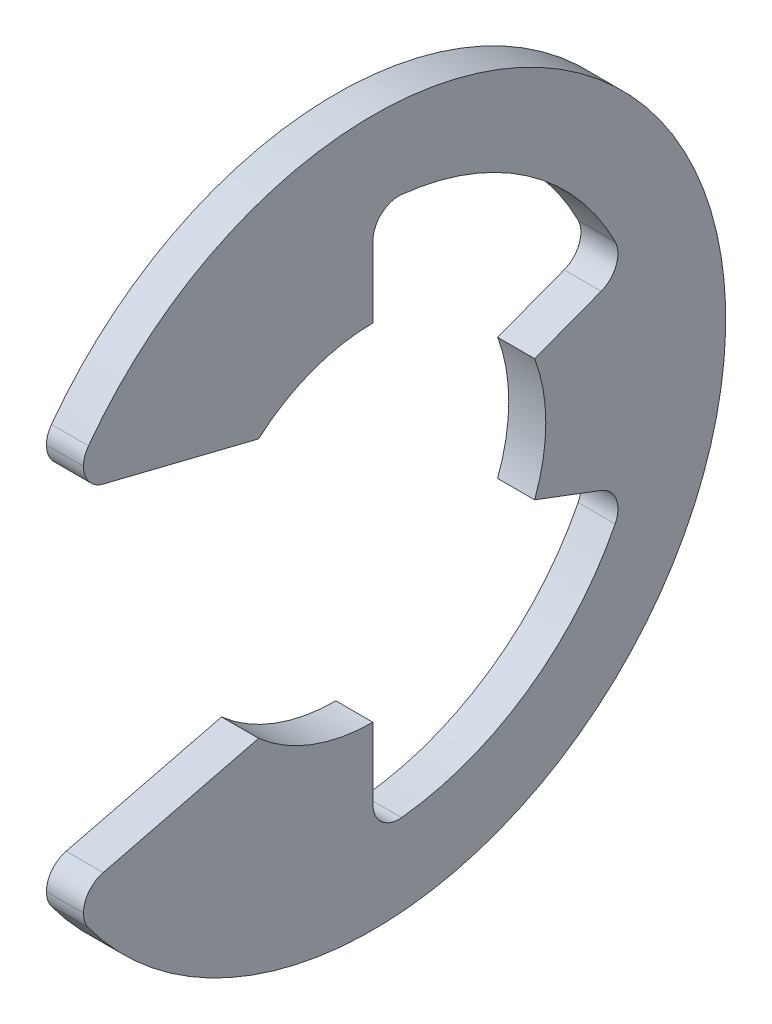
ISO-10303-21;
HEADER;
FILE_DESCRIPTION(('STEP AP214'),'2;1');
FILE_NAME('part.step','',(''),(''),'','','');
FILE_SCHEMA(('AUTOMOTIVE_DESIGN { 1 0 10303 214 1 1 1 1 }'));
ENDSEC;
DATA;
#1=APPLICATION_CONTEXT('core data for automotive mechanical design processes');
#2=APPLICATION_PROTOCOL_DEFINITION('international standard','automotive_design',2000,#1);
#3=PRODUCT_CONTEXT('',#1,'mechanical');
#4=PRODUCT('Part','Part','',(#3));
#5=PRODUCT_RELATED_PRODUCT_CATEGORY('part','',(#4));
#6=PRODUCT_DEFINITION_FORMATION('','',#4);
#7=PRODUCT_DEFINITION_CONTEXT('part definition',#1,'design');
#8=PRODUCT_DEFINITION('design','',#6,#7);
#9=PRODUCT_DEFINITION_SHAPE('','',#8);
#10=(LENGTH_UNIT() NAMED_UNIT(*) SI_UNIT(.MILLI.,.METRE.));
#11=(NAMED_UNIT(*) PLANE_ANGLE_UNIT() SI_UNIT($,.RADIAN.));
#12=(NAMED_UNIT(*) SI_UNIT($,.STERADIAN.) SOLID_ANGLE_UNIT());
#13=UNCERTAINTY_MEASURE_WITH_UNIT(LENGTH_MEASURE(1.E-05),#10,'distance_accuracy_value','');
#14=(GEOMETRIC_REPRESENTATION_CONTEXT(3) GLOBAL_UNCERTAINTY_ASSIGNED_CONTEXT((#13)) GLOBAL_UNIT_ASSIGNED_CONTEXT((#10,
#11,#12)) REPRESENTATION_CONTEXT('',''));
#15=CARTESIAN_POINT('',(0.,0.,0.));
#16=DIRECTION('',(0.,0.,1.));
#17=DIRECTION('',(1.,0.,0.));
#18=AXIS2_PLACEMENT_3D('',#15,#16,#17);
#19=CARTESIAN_POINT('',(0.5334,3.18296391887085,-6.30917472174839));
#20=DIRECTION('',(-1.,0.,0.));
#21=DIRECTION('',(0.,0.,1.));
#22=AXIS2_PLACEMENT_3D('',#19,#20,#21);
#23=CYLINDRICAL_SURFACE('',#22,0.74676);
#24=CARTESIAN_POINT('',(0.5334,3.18296391887085,-6.30917472174839));
#25=DIRECTION('',(-1.,0.,0.));
#26=DIRECTION('',(0.,0.,-1.));
#27=AXIS2_PLACEMENT_3D('',#24,#25,#26);
#28=CIRCLE('',#27,0.74676);
#29=CARTESIAN_POINT('',(0.5334,3.51932193149276,-6.97589339176224));
#30=VERTEX_POINT('',#29);
#31=CARTESIAN_POINT('',(0.5334,2.48443390133403,-6.57319425170782));
#32=VERTEX_POINT('',#31);
#33=EDGE_CURVE('E410',#30,#32,#28,.T.);
#34=ORIENTED_EDGE('',*,*,#33,.F.);
#35=DIRECTION('',(1.,0.,0.));
#36=VECTOR('',#35,1.);
#37=CARTESIAN_POINT('',(0.5334,3.51932193149276,-6.97589339176224));
#38=LINE('',#37,#36);
#39=CARTESIAN_POINT('',(-0.5334,3.51932193149276,-6.97589339176224));
#40=VERTEX_POINT('',#39);
#41=EDGE_CURVE('E289',#40,#30,#38,.T.);
#42=ORIENTED_EDGE('',*,*,#41,.F.);
#43=CARTESIAN_POINT('',(-0.5334,3.18296391887085,-6.30917472174839));
#44=DIRECTION('',(1.,0.,0.));
#45=DIRECTION('',(0.,0.,-1.));
#46=AXIS2_PLACEMENT_3D('',#43,#44,#45);
#47=CIRCLE('',#46,0.74676);
#48=CARTESIAN_POINT('',(-0.5334,2.48443390133403,-6.57319425170782));
#49=VERTEX_POINT('',#48);
#50=EDGE_CURVE('E424',#49,#40,#47,.T.);
#51=ORIENTED_EDGE('',*,*,#50,.F.);
#52=DIRECTION('',(-1.,0.,0.));
#53=VECTOR('',#52,1.);
#54=CARTESIAN_POINT('',(-0.5334,2.48443390133403,-6.57319425170782));
#55=LINE('',#54,#53);
#56=EDGE_CURVE('E238',#32,#49,#55,.T.);
#57=ORIENTED_EDGE('',*,*,#56,.F.);
#58=EDGE_LOOP('',(#34,#42,#51,#57));
#59=FACE_BOUND('',#58,.T.);
#60=ADVANCED_FACE('F16',(#59),#23,.F.);
#61=CARTESIAN_POINT('',(0.5334,-3.18296391887085,-6.30917472174839));
#62=DIRECTION('',(-1.,0.,0.));
#63=DIRECTION('',(0.,0.,1.));
#64=AXIS2_PLACEMENT_3D('',#61,#62,#63);
#65=CYLINDRICAL_SURFACE('',#64,0.74676);
#66=CARTESIAN_POINT('',(0.5334,-3.18296391887085,-6.30917472174839));
#67=DIRECTION('',(-1.,0.,0.));
#68=DIRECTION('',(0.,0.,-1.));
#69=AXIS2_PLACEMENT_3D('',#66,#67,#68);
#70=CIRCLE('',#69,0.74676);
#71=CARTESIAN_POINT('',(0.5334,-2.48443390133402,-6.57319425170782));
#72=VERTEX_POINT('',#71);
#73=CARTESIAN_POINT('',(0.5334,-3.51932193149276,-6.97589339176224));
#74=VERTEX_POINT('',#73);
#75=EDGE_CURVE('E409',#72,#74,#70,.T.);
#76=ORIENTED_EDGE('',*,*,#75,.F.);
#77=DIRECTION('',(1.,0.,0.));
#78=VECTOR('',#77,1.);
#79=CARTESIAN_POINT('',(0.5334,-2.48443390133402,-6.57319425170782));
#80=LINE('',#79,#78);
#81=CARTESIAN_POINT('',(-0.5334,-2.48443390133402,-6.57319425170782));
#82=VERTEX_POINT('',#81);
#83=EDGE_CURVE('E349',#82,#72,#80,.T.);
#84=ORIENTED_EDGE('',*,*,#83,.F.);
#85=CARTESIAN_POINT('',(-0.5334,-3.18296391887085,-6.30917472174839));
#86=DIRECTION('',(1.,0.,0.));
#87=DIRECTION('',(0.,0.,-1.));
#88=AXIS2_PLACEMENT_3D('',#85,#86,#87);
#89=CIRCLE('',#88,0.74676);
#90=CARTESIAN_POINT('',(-0.5334,-3.51932193149276,-6.97589339176224));
#91=VERTEX_POINT('',#90);
#92=EDGE_CURVE('E423',#91,#82,#89,.T.);
#93=ORIENTED_EDGE('',*,*,#92,.F.);
#94=DIRECTION('',(-1.,0.,0.));
#95=VECTOR('',#94,1.);
#96=CARTESIAN_POINT('',(0.5334,-3.51932193149276,-6.97589339176224));
#97=LINE('',#96,#95);
#98=EDGE_CURVE('E367',#74,#91,#97,.T.);
#99=ORIENTED_EDGE('',*,*,#98,.F.);
#100=EDGE_LOOP('',(#76,#84,#93,#99));
#101=FACE_BOUND('',#100,.T.);
#102=ADVANCED_FACE('F18',(#101),#65,.F.);
#103=CARTESIAN_POINT('',(0.5334,5.56971982551659,7.58863020332704));
#104=DIRECTION('',(-1.,0.,0.));
#105=DIRECTION('',(0.,0.,1.));
#106=AXIS2_PLACEMENT_3D('',#103,#104,#105);
#107=CYLINDRICAL_SURFACE('',#106,0.74676);
#108=DIRECTION('',(-1.,0.,0.));
#109=VECTOR('',#108,1.);
#110=CARTESIAN_POINT('',(0.5334,5.56971982551659,8.33539020332704));
#111=LINE('',#110,#109);
#112=CARTESIAN_POINT('',(0.5334,5.56971982551659,8.33539020332704));
#113=VERTEX_POINT('',#112);
#114=CARTESIAN_POINT('',(-0.5334,5.56971982551659,8.33539020332704));
#115=VERTEX_POINT('',#114);
#116=EDGE_CURVE('E220',#113,#115,#111,.T.);
#117=ORIENTED_EDGE('',*,*,#116,.F.);
#118=CARTESIAN_POINT('',(0.5334,5.56971982551659,7.58863020332704));
#119=DIRECTION('',(1.,0.,0.));
#120=DIRECTION('',(0.,0.,-1.));
#121=AXIS2_PLACEMENT_3D('',#118,#119,#120);
#122=CIRCLE('',#121,0.74676);
#123=CARTESIAN_POINT('',(0.5334,6.01157023801035,8.19064242129201));
#124=VERTEX_POINT('',#123);
#125=EDGE_CURVE('E205',#124,#113,#122,.T.);
#126=ORIENTED_EDGE('',*,*,#125,.F.);
#127=DIRECTION('',(1.,0.,0.));
#128=VECTOR('',#127,1.);
#129=CARTESIAN_POINT('',(0.5334,6.01157023801035,8.19064242129201));
#130=LINE('',#129,#128);
#131=CARTESIAN_POINT('',(-0.5334,6.01157023801035,8.19064242129201));
#132=VERTEX_POINT('',#131);
#133=EDGE_CURVE('E278',#132,#124,#130,.T.);
#134=ORIENTED_EDGE('',*,*,#133,.F.);
#135=CARTESIAN_POINT('',(-0.5334,5.56971982551659,7.58863020332704));
#136=DIRECTION('',(-1.,0.,0.));
#137=DIRECTION('',(0.,0.,-1.));
#138=AXIS2_PLACEMENT_3D('',#135,#136,#137);
#139=CIRCLE('',#138,0.74676);
#140=EDGE_CURVE('E11',#115,#132,#139,.T.);
#141=ORIENTED_EDGE('',*,*,#140,.F.);
#142=EDGE_LOOP('',(#117,#126,#134,#141));
#143=FACE_BOUND('',#142,.T.);
#144=ADVANCED_FACE('F217',(#143),#107,.T.);
#145=CARTESIAN_POINT('',(0.5334,-5.56971982551659,7.58863020332704));
#146=DIRECTION('',(-1.,0.,0.));
#147=DIRECTION('',(0.,0.,1.));
#148=AXIS2_PLACEMENT_3D('',#145,#146,#147);
#149=CYLINDRICAL_SURFACE('',#148,0.74676);
#150=DIRECTION('',(-1.,0.,0.));
#151=VECTOR('',#150,1.);
#152=CARTESIAN_POINT('',(0.5334,-5.56971982551659,8.33539020332704));
#153=LINE('',#152,#151);
#154=CARTESIAN_POINT('',(0.5334,-5.56971982551659,8.33539020332704));
#155=VERTEX_POINT('',#154);
#156=CARTESIAN_POINT('',(-0.5334,-5.56971982551659,8.33539020332704));
#157=VERTEX_POINT('',#156);
#158=EDGE_CURVE('E267',#155,#157,#153,.T.);
#159=ORIENTED_EDGE('',*,*,#158,.F.);
#160=CARTESIAN_POINT('',(0.5334,-5.56971982551659,7.58863020332704));
#161=DIRECTION('',(1.,0.,0.));
#162=DIRECTION('',(0.,0.,-1.));
#163=AXIS2_PLACEMENT_3D('',#160,#161,#162);
#164=CIRCLE('',#163,0.74676);
#165=CARTESIAN_POINT('',(0.5334,-4.84496174240152,7.76856413164343));
#166=VERTEX_POINT('',#165);
#167=EDGE_CURVE('E36',#166,#155,#164,.T.);
#168=ORIENTED_EDGE('',*,*,#167,.F.);
#169=DIRECTION('',(1.,0.,0.));
#170=VECTOR('',#169,1.);
#171=CARTESIAN_POINT('',(0.5334,-4.84496174240152,7.76856413164343));
#172=LINE('',#171,#170);
#173=CARTESIAN_POINT('',(-0.5334,-4.84496174240152,7.76856413164343));
#174=VERTEX_POINT('',#173);
#175=EDGE_CURVE('E386',#174,#166,#172,.T.);
#176=ORIENTED_EDGE('',*,*,#175,.F.);
#177=CARTESIAN_POINT('',(-0.5334,-5.56971982551659,7.58863020332704));
#178=DIRECTION('',(-1.,0.,0.));
#179=DIRECTION('',(0.,0.,-1.));
#180=AXIS2_PLACEMENT_3D('',#177,#178,#179);
#181=CIRCLE('',#180,0.74676);
#182=EDGE_CURVE('E47',#157,#174,#181,.T.);
#183=ORIENTED_EDGE('',*,*,#182,.F.);
#184=EDGE_LOOP('',(#159,#168,#176,#183));
#185=FACE_BOUND('',#184,.T.);
#186=ADVANCED_FACE('F494',(#185),#149,.T.);
#187=CARTESIAN_POINT('',(0.5334,7.02704023617216,-0.74676));
#188=DIRECTION('',(-1.,0.,0.));
#189=DIRECTION('',(0.,0.,1.));
#190=AXIS2_PLACEMENT_3D('',#187,#188,#189);
#191=CYLINDRICAL_SURFACE('',#190,0.74676);
#192=CARTESIAN_POINT('',(0.5334,7.02704023617216,-0.74676));
#193=DIRECTION('',(-1.,0.,0.));
#194=DIRECTION('',(0.,0.,-1.));
#195=AXIS2_PLACEMENT_3D('',#192,#193,#194);
#196=CIRCLE('',#195,0.74676);
#197=CARTESIAN_POINT('',(0.5334,7.02704023617216,0.));
#198=VERTEX_POINT('',#197);
#199=CARTESIAN_POINT('',(0.5334,7.76961896112721,-0.825673464276603));
#200=VERTEX_POINT('',#199);
#201=EDGE_CURVE('E212',#198,#200,#196,.T.);
#202=ORIENTED_EDGE('',*,*,#201,.F.);
#203=DIRECTION('',(1.,0.,0.));
#204=VECTOR('',#203,1.);
#205=CARTESIAN_POINT('',(0.5334,7.02704023617216,0.));
#206=LINE('',#205,#204);
#207=CARTESIAN_POINT('',(-0.5334,7.02704023617216,0.));
#208=VERTEX_POINT('',#207);
#209=EDGE_CURVE('E318',#208,#198,#206,.T.);
#210=ORIENTED_EDGE('',*,*,#209,.F.);
#211=CARTESIAN_POINT('',(-0.5334,7.02704023617216,-0.74676));
#212=DIRECTION('',(1.,0.,0.));
#213=DIRECTION('',(0.,0.,-1.));
#214=AXIS2_PLACEMENT_3D('',#211,#212,#213);
#215=CIRCLE('',#214,0.74676);
#216=CARTESIAN_POINT('',(-0.5334,7.76961896112721,-0.825673464276603));
#217=VERTEX_POINT('',#216);
#218=EDGE_CURVE('E25',#217,#208,#215,.T.);
#219=ORIENTED_EDGE('',*,*,#218,.F.);
#220=DIRECTION('',(-1.,0.,0.));
#221=VECTOR('',#220,1.);
#222=CARTESIAN_POINT('',(0.5334,7.76961896112721,-0.825673464276603));
#223=LINE('',#222,#221);
#224=EDGE_CURVE('E248',#200,#217,#223,.T.);
#225=ORIENTED_EDGE('',*,*,#224,.F.);
#226=EDGE_LOOP('',(#202,#210,#219,#225));
#227=FACE_BOUND('',#226,.T.);
#228=ADVANCED_FACE('F442',(#227),#191,.F.);
#229=CARTESIAN_POINT('',(0.5334,-7.02704023617216,-0.74676));
#230=DIRECTION('',(-1.,0.,0.));
#231=DIRECTION('',(0.,0.,1.));
#232=AXIS2_PLACEMENT_3D('',#229,#230,#231);
#233=CYLINDRICAL_SURFACE('',#232,0.74676);
#234=CARTESIAN_POINT('',(0.5334,-7.02704023617216,-0.74676));
#235=DIRECTION('',(-1.,0.,0.));
#236=DIRECTION('',(0.,0.,-1.));
#237=AXIS2_PLACEMENT_3D('',#234,#235,#236);
#238=CIRCLE('',#237,0.74676);
#239=CARTESIAN_POINT('',(0.5334,-7.76961896112721,-0.825673464276605));
#240=VERTEX_POINT('',#239);
#241=CARTESIAN_POINT('',(0.5334,-7.02704023617216,0.));
#242=VERTEX_POINT('',#241);
#243=EDGE_CURVE('E414',#240,#242,#238,.T.);
#244=ORIENTED_EDGE('',*,*,#243,.F.);
#245=DIRECTION('',(1.,0.,0.));
#246=VECTOR('',#245,1.);
#247=CARTESIAN_POINT('',(0.5334,-7.76961896112721,-0.825673464276605));
#248=LINE('',#247,#246);
#249=CARTESIAN_POINT('',(-0.5334,-7.76961896112721,-0.825673464276605));
#250=VERTEX_POINT('',#249);
#251=EDGE_CURVE('E362',#250,#240,#248,.T.);
#252=ORIENTED_EDGE('',*,*,#251,.F.);
#253=CARTESIAN_POINT('',(-0.5334,-7.02704023617216,-0.74676));
#254=DIRECTION('',(1.,0.,0.));
#255=DIRECTION('',(0.,0.,-1.));
#256=AXIS2_PLACEMENT_3D('',#253,#254,#255);
#257=CIRCLE('',#256,0.74676);
#258=CARTESIAN_POINT('',(-0.5334,-7.02704023617216,0.));
#259=VERTEX_POINT('',#258);
#260=EDGE_CURVE('E416',#259,#250,#257,.T.);
#261=ORIENTED_EDGE('',*,*,#260,.F.);
#262=DIRECTION('',(-1.,0.,0.));
#263=VECTOR('',#262,1.);
#264=CARTESIAN_POINT('',(-0.5334,-7.02704023617216,0.));
#265=LINE('',#264,#263);
#266=EDGE_CURVE('E293',#242,#259,#265,.T.);
#267=ORIENTED_EDGE('',*,*,#266,.F.);
#268=EDGE_LOOP('',(#244,#252,#261,#267));
#269=FACE_BOUND('',#268,.T.);
#270=ADVANCED_FACE('F484',(#269),#233,.F.);
#271=CARTESIAN_POINT('',(-0.5334,0.,0.));
#272=DIRECTION('',(1.,0.,0.));
#273=DIRECTION('',(0.,1.,0.));
#274=AXIS2_PLACEMENT_3D('',#271,#272,#273);
#275=PLANE('',#274);
#276=CARTESIAN_POINT('',(-0.5334,0.,0.));
#277=DIRECTION('',(1.,0.,0.));
#278=DIRECTION('',(0.,0.,-1.));
#279=AXIS2_PLACEMENT_3D('',#276,#277,#278);
#280=CIRCLE('',#279,10.16);
#281=CARTESIAN_POINT('',(-0.5334,-6.01157023801035,8.19064242129201));
#282=VERTEX_POINT('',#281);
#283=EDGE_CURVE('E260',#282,#132,#280,.T.);
#284=ORIENTED_EDGE('',*,*,#283,.F.);
#285=CARTESIAN_POINT('',(-0.5334,-5.56971982551659,7.58863020332704));
#286=DIRECTION('',(-1.,0.,0.));
#287=DIRECTION('',(0.,0.,-1.));
#288=AXIS2_PLACEMENT_3D('',#285,#286,#287);
#289=CIRCLE('',#288,0.74676);
#290=EDGE_CURVE('E272',#282,#157,#289,.T.);
#291=ORIENTED_EDGE('',*,*,#290,.T.);
#292=ORIENTED_EDGE('',*,*,#182,.T.);
#293=DIRECTION('',(0.,-0.240952820606873,0.970536829925373));
#294=VECTOR('',#293,1.);
#295=CARTESIAN_POINT('',(-0.5334,-5.09813480407811,8.78832302088672));
#296=LINE('',#295,#294);
#297=CARTESIAN_POINT('',(-0.5334,-3.7338,3.29290208175099));
#298=VERTEX_POINT('',#297);
#299=EDGE_CURVE('E393',#298,#174,#296,.T.);
#300=ORIENTED_EDGE('',*,*,#299,.F.);
#301=CARTESIAN_POINT('',(-0.5334,0.,0.));
#302=DIRECTION('',(-1.,0.,0.));
#303=DIRECTION('',(0.,0.,-1.));
#304=AXIS2_PLACEMENT_3D('',#301,#302,#303);
#305=CIRCLE('',#304,4.9784);
#306=CARTESIAN_POINT('',(-0.5334,-4.9784,0.));
#307=VERTEX_POINT('',#306);
#308=EDGE_CURVE('E379',#307,#298,#305,.T.);
#309=ORIENTED_EDGE('',*,*,#308,.F.);
#310=DIRECTION('',(0.,1.,0.));
#311=VECTOR('',#310,1.);
#312=CARTESIAN_POINT('',(-0.5334,-4.9784,0.));
#313=LINE('',#312,#311);
#314=EDGE_CURVE('E300',#259,#307,#313,.T.);
#315=ORIENTED_EDGE('',*,*,#314,.F.);
#316=ORIENTED_EDGE('',*,*,#260,.T.);
#317=CARTESIAN_POINT('',(-0.5334,0.,0.));
#318=DIRECTION('',(-1.,0.,0.));
#319=DIRECTION('',(0.,0.,-1.));
#320=AXIS2_PLACEMENT_3D('',#317,#318,#319);
#321=CIRCLE('',#320,7.81336774193548);
#322=EDGE_CURVE('E359',#91,#250,#321,.T.);
#323=ORIENTED_EDGE('',*,*,#322,.F.);
#324=ORIENTED_EDGE('',*,*,#92,.T.);
#325=DIRECTION('',(0.,-0.353553390593274,-0.935414346693485));
#326=VECTOR('',#325,1.);
#327=CARTESIAN_POINT('',(-0.5334,-1.76013019972956,-4.65686678357885));
#328=LINE('',#327,#326);
#329=CARTESIAN_POINT('',(-0.5334,-1.76013019972956,-4.65686678357885));
#330=VERTEX_POINT('',#329);
#331=EDGE_CURVE('E345',#330,#82,#328,.T.);
#332=ORIENTED_EDGE('',*,*,#331,.F.);
#333=CARTESIAN_POINT('',(-0.5334,0.,0.));
#334=DIRECTION('',(-1.,0.,0.));
#335=DIRECTION('',(0.,0.,1.));
#336=AXIS2_PLACEMENT_3D('',#333,#334,#335);
#337=CIRCLE('',#336,4.9784);
#338=CARTESIAN_POINT('',(-0.5334,1.76013019972956,-4.65686678357885));
#339=VERTEX_POINT('',#338);
#340=EDGE_CURVE('E266',#339,#330,#337,.T.);
#341=ORIENTED_EDGE('',*,*,#340,.F.);
#342=DIRECTION('',(0.,-0.353553390593274,0.935414346693485));
#343=VECTOR('',#342,1.);
#344=CARTESIAN_POINT('',(-0.5334,1.76013019972956,-4.65686678357885));
#345=LINE('',#344,#343);
#346=EDGE_CURVE('E245',#49,#339,#345,.T.);
#347=ORIENTED_EDGE('',*,*,#346,.F.);
#348=ORIENTED_EDGE('',*,*,#50,.T.);
#349=CARTESIAN_POINT('',(-0.5334,0.,0.));
#350=DIRECTION('',(-1.,0.,0.));
#351=DIRECTION('',(0.,0.,-1.));
#352=AXIS2_PLACEMENT_3D('',#349,#350,#351);
#353=CIRCLE('',#352,7.81336774193549);
#354=EDGE_CURVE('E255',#217,#40,#353,.T.);
#355=ORIENTED_EDGE('',*,*,#354,.F.);
#356=ORIENTED_EDGE('',*,*,#218,.T.);
#357=DIRECTION('',(0.,1.,0.));
#358=VECTOR('',#357,1.);
#359=CARTESIAN_POINT('',(-0.5334,4.9784,0.));
#360=LINE('',#359,#358);
#361=CARTESIAN_POINT('',(-0.5334,4.9784,0.));
#362=VERTEX_POINT('',#361);
#363=EDGE_CURVE('E314',#362,#208,#360,.T.);
#364=ORIENTED_EDGE('',*,*,#363,.F.);
#365=CARTESIAN_POINT('',(-0.5334,0.,0.));
#366=DIRECTION('',(-1.,0.,0.));
#367=DIRECTION('',(0.,0.,1.));
#368=AXIS2_PLACEMENT_3D('',#365,#366,#367);
#369=CIRCLE('',#368,4.9784);
#370=CARTESIAN_POINT('',(-0.5334,3.7338,3.29290208175099));
#371=VERTEX_POINT('',#370);
#372=EDGE_CURVE('E249',#371,#362,#369,.T.);
#373=ORIENTED_EDGE('',*,*,#372,.F.);
#374=DIRECTION('',(0.,-0.240952820606873,-0.970536829925373));
#375=VECTOR('',#374,1.);
#376=CARTESIAN_POINT('',(-0.5334,5.09813480407811,8.78832302088672));
#377=LINE('',#376,#375);
#378=CARTESIAN_POINT('',(-0.5334,4.84496174240152,7.76856413164343));
#379=VERTEX_POINT('',#378);
#380=EDGE_CURVE('E246',#379,#371,#377,.T.);
#381=ORIENTED_EDGE('',*,*,#380,.F.);
#382=CARTESIAN_POINT('',(-0.5334,5.56971982551659,7.58863020332704));
#383=DIRECTION('',(-1.,0.,0.));
#384=DIRECTION('',(0.,0.,-1.));
#385=AXIS2_PLACEMENT_3D('',#382,#383,#384);
#386=CIRCLE('',#385,0.74676);
#387=EDGE_CURVE('E224',#379,#115,#386,.T.);
#388=ORIENTED_EDGE('',*,*,#387,.T.);
#389=ORIENTED_EDGE('',*,*,#140,.T.);
#390=EDGE_LOOP('',(#284,#291,#292,#300,#309,#315,#316,#323,#324,#332,#341,#347,#348,#355,#356,
#364,#373,#381,#388,#389));
#391=FACE_BOUND('',#390,.T.);
#392=ADVANCED_FACE('F435',(#391),#275,.F.);
#393=CARTESIAN_POINT('',(0.5334,0.,0.));
#394=DIRECTION('',(1.,0.,0.));
#395=DIRECTION('',(0.,1.,0.));
#396=AXIS2_PLACEMENT_3D('',#393,#394,#395);
#397=PLANE('',#396);
#398=DIRECTION('',(0.,-0.240952820606873,0.970536829925373));
#399=VECTOR('',#398,1.);
#400=CARTESIAN_POINT('',(0.5334,-5.09813480407811,8.78832302088672));
#401=LINE('',#400,#399);
#402=CARTESIAN_POINT('',(0.5334,-3.7338,3.29290208175099));
#403=VERTEX_POINT('',#402);
#404=EDGE_CURVE('E394',#403,#166,#401,.T.);
#405=ORIENTED_EDGE('',*,*,#404,.T.);
#406=ORIENTED_EDGE('',*,*,#167,.T.);
#407=CARTESIAN_POINT('',(0.5334,-5.56971982551659,7.58863020332704));
#408=DIRECTION('',(1.,0.,0.));
#409=DIRECTION('',(0.,0.,-1.));
#410=AXIS2_PLACEMENT_3D('',#407,#408,#409);
#411=CIRCLE('',#410,0.74676);
#412=CARTESIAN_POINT('',(0.5334,-6.01157023801035,8.19064242129201));
#413=VERTEX_POINT('',#412);
#414=EDGE_CURVE('E240',#155,#413,#411,.T.);
#415=ORIENTED_EDGE('',*,*,#414,.T.);
#416=CARTESIAN_POINT('',(0.5334,0.,0.));
#417=DIRECTION('',(1.,0.,0.));
#418=DIRECTION('',(0.,0.,-1.));
#419=AXIS2_PLACEMENT_3D('',#416,#417,#418);
#420=CIRCLE('',#419,10.16);
#421=EDGE_CURVE('E207',#413,#124,#420,.T.);
#422=ORIENTED_EDGE('',*,*,#421,.T.);
#423=ORIENTED_EDGE('',*,*,#125,.T.);
#424=CARTESIAN_POINT('',(0.5334,5.56971982551659,7.58863020332704));
#425=DIRECTION('',(1.,0.,0.));
#426=DIRECTION('',(0.,0.,-1.));
#427=AXIS2_PLACEMENT_3D('',#424,#425,#426);
#428=CIRCLE('',#427,0.74676);
#429=CARTESIAN_POINT('',(0.5334,4.84496174240152,7.76856413164343));
#430=VERTEX_POINT('',#429);
#431=EDGE_CURVE('E210',#113,#430,#428,.T.);
#432=ORIENTED_EDGE('',*,*,#431,.T.);
#433=DIRECTION('',(0.,-0.240952820606873,-0.970536829925373));
#434=VECTOR('',#433,1.);
#435=CARTESIAN_POINT('',(0.5334,5.09813480407811,8.78832302088672));
#436=LINE('',#435,#434);
#437=CARTESIAN_POINT('',(0.5334,3.7338,3.29290208175099));
#438=VERTEX_POINT('',#437);
#439=EDGE_CURVE('E283',#430,#438,#436,.T.);
#440=ORIENTED_EDGE('',*,*,#439,.T.);
#441=CARTESIAN_POINT('',(0.5334,0.,0.));
#442=DIRECTION('',(-1.,0.,0.));
#443=DIRECTION('',(0.,0.,1.));
#444=AXIS2_PLACEMENT_3D('',#441,#442,#443);
#445=CIRCLE('',#444,4.9784);
#446=CARTESIAN_POINT('',(0.5334,4.9784,0.));
#447=VERTEX_POINT('',#446);
#448=EDGE_CURVE('E309',#438,#447,#445,.T.);
#449=ORIENTED_EDGE('',*,*,#448,.T.);
#450=DIRECTION('',(0.,1.,0.));
#451=VECTOR('',#450,1.);
#452=CARTESIAN_POINT('',(0.5334,4.9784,0.));
#453=LINE('',#452,#451);
#454=EDGE_CURVE('E325',#447,#198,#453,.T.);
#455=ORIENTED_EDGE('',*,*,#454,.T.);
#456=ORIENTED_EDGE('',*,*,#201,.T.);
#457=CARTESIAN_POINT('',(0.5334,0.,0.));
#458=DIRECTION('',(-1.,0.,0.));
#459=DIRECTION('',(0.,0.,-1.));
#460=AXIS2_PLACEMENT_3D('',#457,#458,#459);
#461=CIRCLE('',#460,7.81336774193549);
#462=EDGE_CURVE('E254',#200,#30,#461,.T.);
#463=ORIENTED_EDGE('',*,*,#462,.T.);
#464=ORIENTED_EDGE('',*,*,#33,.T.);
#465=DIRECTION('',(0.,-0.353553390593274,0.935414346693485));
#466=VECTOR('',#465,1.);
#467=CARTESIAN_POINT('',(0.5334,1.76013019972956,-4.65686678357885));
#468=LINE('',#467,#466);
#469=CARTESIAN_POINT('',(0.5334,1.76013019972956,-4.65686678357885));
#470=VERTEX_POINT('',#469);
#471=EDGE_CURVE('E242',#32,#470,#468,.T.);
#472=ORIENTED_EDGE('',*,*,#471,.T.);
#473=CARTESIAN_POINT('',(0.5334,0.,0.));
#474=DIRECTION('',(-1.,0.,0.));
#475=DIRECTION('',(0.,0.,1.));
#476=AXIS2_PLACEMENT_3D('',#473,#474,#475);
#477=CIRCLE('',#476,4.9784);
#478=CARTESIAN_POINT('',(0.5334,-1.76013019972956,-4.65686678357885));
#479=VERTEX_POINT('',#478);
#480=EDGE_CURVE('E339',#470,#479,#477,.T.);
#481=ORIENTED_EDGE('',*,*,#480,.T.);
#482=DIRECTION('',(0.,-0.353553390593274,-0.935414346693485));
#483=VECTOR('',#482,1.);
#484=CARTESIAN_POINT('',(0.5334,-1.76013019972956,-4.65686678357885));
#485=LINE('',#484,#483);
#486=EDGE_CURVE('E353',#479,#72,#485,.T.);
#487=ORIENTED_EDGE('',*,*,#486,.T.);
#488=ORIENTED_EDGE('',*,*,#75,.T.);
#489=CARTESIAN_POINT('',(0.5334,0.,0.));
#490=DIRECTION('',(-1.,0.,0.));
#491=DIRECTION('',(0.,0.,-1.));
#492=AXIS2_PLACEMENT_3D('',#489,#490,#491);
#493=CIRCLE('',#492,7.81336774193548);
#494=EDGE_CURVE('E368',#74,#240,#493,.T.);
#495=ORIENTED_EDGE('',*,*,#494,.T.);
#496=ORIENTED_EDGE('',*,*,#243,.T.);
#497=DIRECTION('',(0.,1.,0.));
#498=VECTOR('',#497,1.);
#499=CARTESIAN_POINT('',(0.5334,-4.9784,0.));
#500=LINE('',#499,#498);
#501=CARTESIAN_POINT('',(0.5334,-4.9784,0.));
#502=VERTEX_POINT('',#501);
#503=EDGE_CURVE('E297',#242,#502,#500,.T.);
#504=ORIENTED_EDGE('',*,*,#503,.T.);
#505=CARTESIAN_POINT('',(0.5334,0.,0.));
#506=DIRECTION('',(-1.,0.,0.));
#507=DIRECTION('',(0.,0.,-1.));
#508=AXIS2_PLACEMENT_3D('',#505,#506,#507);
#509=CIRCLE('',#508,4.9784);
#510=EDGE_CURVE('E389',#502,#403,#509,.T.);
#511=ORIENTED_EDGE('',*,*,#510,.T.);
#512=EDGE_LOOP('',(#405,#406,#415,#422,#423,#432,#440,#449,#455,#456,#463,#464,#472,#481,#487,
#488,#495,#496,#504,#511));
#513=FACE_BOUND('',#512,.T.);
#514=ADVANCED_FACE('F204',(#513),#397,.T.);
#515=CARTESIAN_POINT('',(0.5334,-5.09813480407811,8.78832302088672));
#516=DIRECTION('',(0.,-0.970536829925373,-0.240952820606873));
#517=DIRECTION('',(0.,0.240952820606873,-0.970536829925373));
#518=AXIS2_PLACEMENT_3D('',#515,#516,#517);
#519=PLANE('',#518);
#520=ORIENTED_EDGE('',*,*,#299,.T.);
#521=ORIENTED_EDGE('',*,*,#175,.T.);
#522=ORIENTED_EDGE('',*,*,#404,.F.);
#523=DIRECTION('',(-1.,0.,0.));
#524=VECTOR('',#523,1.);
#525=CARTESIAN_POINT('',(0.5334,-3.7338,3.29290208175099));
#526=LINE('',#525,#524);
#527=EDGE_CURVE('E383',#403,#298,#526,.T.);
#528=ORIENTED_EDGE('',*,*,#527,.T.);
#529=EDGE_LOOP('',(#520,#521,#522,#528));
#530=FACE_BOUND('',#529,.T.);
#531=ADVANCED_FACE('F493',(#530),#519,.F.);
#532=CARTESIAN_POINT('',(0.5334,0.,0.));
#533=DIRECTION('',(-1.,0.,0.));
#534=DIRECTION('',(0.,0.,1.));
#535=AXIS2_PLACEMENT_3D('',#532,#533,#534);
#536=CYLINDRICAL_SURFACE('',#535,4.9784);
#537=ORIENTED_EDGE('',*,*,#308,.T.);
#538=ORIENTED_EDGE('',*,*,#527,.F.);
#539=ORIENTED_EDGE('',*,*,#510,.F.);
#540=DIRECTION('',(-1.,0.,0.));
#541=VECTOR('',#540,1.);
#542=CARTESIAN_POINT('',(0.5334,-4.9784,0.));
#543=LINE('',#542,#541);
#544=EDGE_CURVE('E350',#502,#307,#543,.T.);
#545=ORIENTED_EDGE('',*,*,#544,.T.);
#546=EDGE_LOOP('',(#537,#538,#539,#545));
#547=FACE_BOUND('',#546,.T.);
#548=ADVANCED_FACE('F491',(#547),#536,.F.);
#549=CARTESIAN_POINT('',(0.5334,-4.9784,0.));
#550=DIRECTION('',(0.,0.,1.));
#551=DIRECTION('',(0.,-1.,0.));
#552=AXIS2_PLACEMENT_3D('',#549,#550,#551);
#553=PLANE('',#552);
#554=ORIENTED_EDGE('',*,*,#503,.F.);
#555=ORIENTED_EDGE('',*,*,#266,.T.);
#556=ORIENTED_EDGE('',*,*,#314,.T.);
#557=ORIENTED_EDGE('',*,*,#544,.F.);
#558=EDGE_LOOP('',(#554,#555,#556,#557));
#559=FACE_BOUND('',#558,.T.);
#560=ADVANCED_FACE('F487',(#559),#553,.F.);
#561=CARTESIAN_POINT('',(0.5334,0.,0.));
#562=DIRECTION('',(-1.,0.,0.));
#563=DIRECTION('',(0.,0.,1.));
#564=AXIS2_PLACEMENT_3D('',#561,#562,#563);
#565=CYLINDRICAL_SURFACE('',#564,7.81336774193548);
#566=ORIENTED_EDGE('',*,*,#322,.T.);
#567=ORIENTED_EDGE('',*,*,#251,.T.);
#568=ORIENTED_EDGE('',*,*,#494,.F.);
#569=ORIENTED_EDGE('',*,*,#98,.T.);
#570=EDGE_LOOP('',(#566,#567,#568,#569));
#571=FACE_BOUND('',#570,.T.);
#572=ADVANCED_FACE('F477',(#571),#565,.F.);
#573=CARTESIAN_POINT('',(0.5334,-1.76013019972956,-4.65686678357885));
#574=DIRECTION('',(0.,0.935414346693485,-0.353553390593274));
#575=DIRECTION('',(-1.,0.,0.));
#576=AXIS2_PLACEMENT_3D('',#573,#574,#575);
#577=PLANE('',#576);
#578=ORIENTED_EDGE('',*,*,#331,.T.);
#579=ORIENTED_EDGE('',*,*,#83,.T.);
#580=ORIENTED_EDGE('',*,*,#486,.F.);
#581=DIRECTION('',(-1.,0.,0.));
#582=VECTOR('',#581,1.);
#583=CARTESIAN_POINT('',(0.5334,-1.76013019972956,-4.65686678357885));
#584=LINE('',#583,#582);
#585=EDGE_CURVE('E305',#479,#330,#584,.T.);
#586=ORIENTED_EDGE('',*,*,#585,.T.);
#587=EDGE_LOOP('',(#578,#579,#580,#586));
#588=FACE_BOUND('',#587,.T.);
#589=ADVANCED_FACE('F474',(#588),#577,.F.);
#590=CARTESIAN_POINT('',(0.5334,0.,0.));
#591=DIRECTION('',(-1.,0.,0.));
#592=DIRECTION('',(0.,0.,1.));
#593=AXIS2_PLACEMENT_3D('',#590,#591,#592);
#594=CYLINDRICAL_SURFACE('',#593,4.9784);
#595=ORIENTED_EDGE('',*,*,#340,.T.);
#596=ORIENTED_EDGE('',*,*,#585,.F.);
#597=ORIENTED_EDGE('',*,*,#480,.F.);
#598=DIRECTION('',(-1.,0.,0.));
#599=VECTOR('',#598,1.);
#600=CARTESIAN_POINT('',(0.5334,1.76013019972956,-4.65686678357885));
#601=LINE('',#600,#599);
#602=EDGE_CURVE('E265',#470,#339,#601,.T.);
#603=ORIENTED_EDGE('',*,*,#602,.T.);
#604=EDGE_LOOP('',(#595,#596,#597,#603));
#605=FACE_BOUND('',#604,.T.);
#606=ADVANCED_FACE('F468',(#605),#594,.F.);
#607=CARTESIAN_POINT('',(0.5334,1.76013019972956,-4.65686678357885));
#608=DIRECTION('',(0.,-0.935414346693485,-0.353553390593274));
#609=DIRECTION('',(0.,0.353553390593274,-0.935414346693485));
#610=AXIS2_PLACEMENT_3D('',#607,#608,#609);
#611=PLANE('',#610);
#612=ORIENTED_EDGE('',*,*,#471,.F.);
#613=ORIENTED_EDGE('',*,*,#56,.T.);
#614=ORIENTED_EDGE('',*,*,#346,.T.);
#615=ORIENTED_EDGE('',*,*,#602,.F.);
#616=EDGE_LOOP('',(#612,#613,#614,#615));
#617=FACE_BOUND('',#616,.T.);
#618=ADVANCED_FACE('F469',(#617),#611,.F.);
#619=CARTESIAN_POINT('',(0.5334,0.,0.));
#620=DIRECTION('',(-1.,0.,0.));
#621=DIRECTION('',(0.,0.,1.));
#622=AXIS2_PLACEMENT_3D('',#619,#620,#621);
#623=CYLINDRICAL_SURFACE('',#622,7.81336774193549);
#624=ORIENTED_EDGE('',*,*,#462,.F.);
#625=ORIENTED_EDGE('',*,*,#224,.T.);
#626=ORIENTED_EDGE('',*,*,#354,.T.);
#627=ORIENTED_EDGE('',*,*,#41,.T.);
#628=EDGE_LOOP('',(#624,#625,#626,#627));
#629=FACE_BOUND('',#628,.T.);
#630=ADVANCED_FACE('F437',(#629),#623,.F.);
#631=CARTESIAN_POINT('',(0.5334,4.9784,0.));
#632=DIRECTION('',(0.,0.,1.));
#633=DIRECTION('',(0.,-1.,0.));
#634=AXIS2_PLACEMENT_3D('',#631,#632,#633);
#635=PLANE('',#634);
#636=ORIENTED_EDGE('',*,*,#363,.T.);
#637=ORIENTED_EDGE('',*,*,#209,.T.);
#638=ORIENTED_EDGE('',*,*,#454,.F.);
#639=DIRECTION('',(-1.,0.,0.));
#640=VECTOR('',#639,1.);
#641=CARTESIAN_POINT('',(0.5334,4.9784,0.));
#642=LINE('',#641,#640);
#643=EDGE_CURVE('E308',#447,#362,#642,.T.);
#644=ORIENTED_EDGE('',*,*,#643,.T.);
#645=EDGE_LOOP('',(#636,#637,#638,#644));
#646=FACE_BOUND('',#645,.T.);
#647=ADVANCED_FACE('F443',(#646),#635,.F.);
#648=CARTESIAN_POINT('',(0.5334,0.,0.));
#649=DIRECTION('',(-1.,0.,0.));
#650=DIRECTION('',(0.,0.,1.));
#651=AXIS2_PLACEMENT_3D('',#648,#649,#650);
#652=CYLINDRICAL_SURFACE('',#651,4.9784);
#653=ORIENTED_EDGE('',*,*,#372,.T.);
#654=ORIENTED_EDGE('',*,*,#643,.F.);
#655=ORIENTED_EDGE('',*,*,#448,.F.);
#656=DIRECTION('',(-1.,0.,0.));
#657=VECTOR('',#656,1.);
#658=CARTESIAN_POINT('',(0.5334,3.7338,3.29290208175099));
#659=LINE('',#658,#657);
#660=EDGE_CURVE('E243',#438,#371,#659,.T.);
#661=ORIENTED_EDGE('',*,*,#660,.T.);
#662=EDGE_LOOP('',(#653,#654,#655,#661));
#663=FACE_BOUND('',#662,.T.);
#664=ADVANCED_FACE('F447',(#663),#652,.F.);
#665=CARTESIAN_POINT('',(0.5334,5.09813480407811,8.78832302088672));
#666=DIRECTION('',(0.,0.970536829925373,-0.240952820606873));
#667=DIRECTION('',(-1.,0.,0.));
#668=AXIS2_PLACEMENT_3D('',#665,#666,#667);
#669=PLANE('',#668);
#670=ORIENTED_EDGE('',*,*,#439,.F.);
#671=DIRECTION('',(-1.,0.,0.));
#672=VECTOR('',#671,1.);
#673=CARTESIAN_POINT('',(0.5334,4.84496174240152,7.76856413164343));
#674=LINE('',#673,#672);
#675=EDGE_CURVE('E229',#430,#379,#674,.T.);
#676=ORIENTED_EDGE('',*,*,#675,.T.);
#677=ORIENTED_EDGE('',*,*,#380,.T.);
#678=ORIENTED_EDGE('',*,*,#660,.F.);
#679=EDGE_LOOP('',(#670,#676,#677,#678));
#680=FACE_BOUND('',#679,.T.);
#681=ADVANCED_FACE('F450',(#680),#669,.F.);
#682=CARTESIAN_POINT('',(0.5334,0.,0.));
#683=DIRECTION('',(-1.,0.,0.));
#684=DIRECTION('',(0.,0.,1.));
#685=AXIS2_PLACEMENT_3D('',#682,#683,#684);
#686=CYLINDRICAL_SURFACE('',#685,10.16);
#687=ORIENTED_EDGE('',*,*,#421,.F.);
#688=DIRECTION('',(-1.,0.,0.));
#689=VECTOR('',#688,1.);
#690=CARTESIAN_POINT('',(0.5334,-6.01157023801035,8.190642421292));
#691=LINE('',#690,#689);
#692=EDGE_CURVE('E256',#413,#282,#691,.T.);
#693=ORIENTED_EDGE('',*,*,#692,.T.);
#694=ORIENTED_EDGE('',*,*,#283,.T.);
#695=ORIENTED_EDGE('',*,*,#133,.T.);
#696=EDGE_LOOP('',(#687,#693,#694,#695));
#697=FACE_BOUND('',#696,.T.);
#698=ADVANCED_FACE('F455',(#697),#686,.T.);
#699=CARTESIAN_POINT('',(0.5334,-5.56971982551659,7.58863020332704));
#700=DIRECTION('',(-1.,0.,0.));
#701=DIRECTION('',(0.,0.,1.));
#702=AXIS2_PLACEMENT_3D('',#699,#700,#701);
#703=CYLINDRICAL_SURFACE('',#702,0.74676);
#704=ORIENTED_EDGE('',*,*,#414,.F.);
#705=ORIENTED_EDGE('',*,*,#158,.T.);
#706=ORIENTED_EDGE('',*,*,#290,.F.);
#707=ORIENTED_EDGE('',*,*,#692,.F.);
#708=EDGE_LOOP('',(#704,#705,#706,#707));
#709=FACE_BOUND('',#708,.T.);
#710=ADVANCED_FACE('F456',(#709),#703,.T.);
#711=CARTESIAN_POINT('',(0.5334,5.56971982551659,7.58863020332704));
#712=DIRECTION('',(-1.,0.,0.));
#713=DIRECTION('',(0.,0.,1.));
#714=AXIS2_PLACEMENT_3D('',#711,#712,#713);
#715=CYLINDRICAL_SURFACE('',#714,0.74676);
#716=ORIENTED_EDGE('',*,*,#431,.F.);
#717=ORIENTED_EDGE('',*,*,#116,.T.);
#718=ORIENTED_EDGE('',*,*,#387,.F.);
#719=ORIENTED_EDGE('',*,*,#675,.F.);
#720=EDGE_LOOP('',(#716,#717,#718,#719));
#721=FACE_BOUND('',#720,.T.);
#722=ADVANCED_FACE('F226',(#721),#715,.T.);
#723=CLOSED_SHELL('',(#60,#102,#144,#186,#228,#270,#392,#514,#531,#548,#560,#572,#589,#606,#618,
#630,#647,#664,#681,#698,#710,#722));
#724=MANIFOLD_SOLID_BREP('B1',#723);
#725=ADVANCED_BREP_SHAPE_REPRESENTATION('',(#18,#724),#14);
#726=SHAPE_DEFINITION_REPRESENTATION(#9,#725);
ENDSEC;
END-ISO-10303-21;
